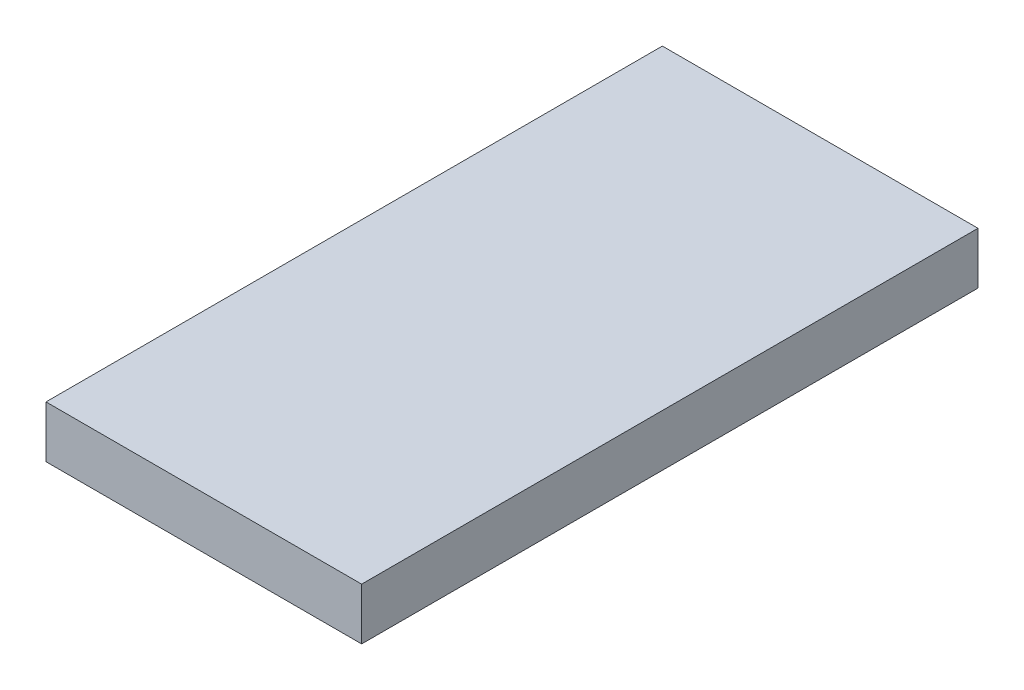
ISO-10303-21;
HEADER;
FILE_DESCRIPTION(('STEP AP214'),'2;1');
FILE_NAME('part.step','',(''),(''),'','','');
FILE_SCHEMA(('AUTOMOTIVE_DESIGN { 1 0 10303 214 1 1 1 1 }'));
ENDSEC;
DATA;
#1=APPLICATION_CONTEXT('core data for automotive mechanical design processes');
#2=APPLICATION_PROTOCOL_DEFINITION('international standard','automotive_design',2000,#1);
#3=PRODUCT_CONTEXT('',#1,'mechanical');
#4=PRODUCT('Part','Part','',(#3));
#5=PRODUCT_RELATED_PRODUCT_CATEGORY('part','',(#4));
#6=PRODUCT_DEFINITION_FORMATION('','',#4);
#7=PRODUCT_DEFINITION_CONTEXT('part definition',#1,'design');
#8=PRODUCT_DEFINITION('design','',#6,#7);
#9=PRODUCT_DEFINITION_SHAPE('','',#8);
#10=(LENGTH_UNIT() NAMED_UNIT(*) SI_UNIT(.MILLI.,.METRE.));
#11=(NAMED_UNIT(*) PLANE_ANGLE_UNIT() SI_UNIT($,.RADIAN.));
#12=(NAMED_UNIT(*) SI_UNIT($,.STERADIAN.) SOLID_ANGLE_UNIT());
#13=UNCERTAINTY_MEASURE_WITH_UNIT(LENGTH_MEASURE(1.E-05),#10,'distance_accuracy_value','');
#14=(GEOMETRIC_REPRESENTATION_CONTEXT(3) GLOBAL_UNCERTAINTY_ASSIGNED_CONTEXT((#13)) GLOBAL_UNIT_ASSIGNED_CONTEXT((#10,
#11,#12)) REPRESENTATION_CONTEXT('',''));
#15=CARTESIAN_POINT('',(0.,0.,0.));
#16=DIRECTION('',(0.,0.,1.));
#17=DIRECTION('',(1.,0.,0.));
#18=AXIS2_PLACEMENT_3D('',#15,#16,#17);
#19=CARTESIAN_POINT('',(0.,10.84,0.));
#20=DIRECTION('',(1.,0.,0.));
#21=DIRECTION('',(0.,0.,-1.));
#22=AXIS2_PLACEMENT_3D('',#19,#20,#21);
#23=PLANE('',#22);
#24=DIRECTION('',(0.,0.,1.));
#25=VECTOR('',#24,1.);
#26=CARTESIAN_POINT('',(0.,0.,0.));
#27=LINE('',#26,#25);
#28=CARTESIAN_POINT('',(0.,0.,-128.96));
#29=VERTEX_POINT('',#28);
#30=CARTESIAN_POINT('',(0.,0.,0.));
#31=VERTEX_POINT('',#30);
#32=EDGE_CURVE('E95',#29,#31,#27,.T.);
#33=ORIENTED_EDGE('',*,*,#32,.T.);
#34=DIRECTION('',(0.,-1.,0.));
#35=VECTOR('',#34,1.);
#36=CARTESIAN_POINT('',(0.,10.84,0.));
#37=LINE('',#36,#35);
#38=CARTESIAN_POINT('',(0.,10.84,0.));
#39=VERTEX_POINT('',#38);
#40=EDGE_CURVE('E11',#39,#31,#37,.T.);
#41=ORIENTED_EDGE('',*,*,#40,.F.);
#42=DIRECTION('',(0.,0.,1.));
#43=VECTOR('',#42,1.);
#44=CARTESIAN_POINT('',(0.,10.84,0.));
#45=LINE('',#44,#43);
#46=CARTESIAN_POINT('',(0.,10.84,-128.96));
#47=VERTEX_POINT('',#46);
#48=EDGE_CURVE('E83',#47,#39,#45,.T.);
#49=ORIENTED_EDGE('',*,*,#48,.F.);
#50=DIRECTION('',(0.,-1.,0.));
#51=VECTOR('',#50,1.);
#52=CARTESIAN_POINT('',(0.,10.84,-128.96));
#53=LINE('',#52,#51);
#54=EDGE_CURVE('E91',#47,#29,#53,.T.);
#55=ORIENTED_EDGE('',*,*,#54,.T.);
#56=EDGE_LOOP('',(#33,#41,#49,#55));
#57=FACE_BOUND('',#56,.T.);
#58=ADVANCED_FACE('F32',(#57),#23,.F.);
#59=CARTESIAN_POINT('',(0.,10.84,0.));
#60=DIRECTION('',(0.,0.,-1.));
#61=DIRECTION('',(-1.,0.,0.));
#62=AXIS2_PLACEMENT_3D('',#59,#60,#61);
#63=PLANE('',#62);
#64=DIRECTION('',(1.,0.,0.));
#65=VECTOR('',#64,1.);
#66=CARTESIAN_POINT('',(0.,0.,0.));
#67=LINE('',#66,#65);
#68=CARTESIAN_POINT('',(66.04,0.,0.));
#69=VERTEX_POINT('',#68);
#70=EDGE_CURVE('E87',#31,#69,#67,.T.);
#71=ORIENTED_EDGE('',*,*,#70,.T.);
#72=DIRECTION('',(0.,-1.,0.));
#73=VECTOR('',#72,1.);
#74=CARTESIAN_POINT('',(66.04,10.84,0.));
#75=LINE('',#74,#73);
#76=CARTESIAN_POINT('',(66.04,10.84,0.));
#77=VERTEX_POINT('',#76);
#78=EDGE_CURVE('E40',#77,#69,#75,.T.);
#79=ORIENTED_EDGE('',*,*,#78,.F.);
#80=DIRECTION('',(1.,0.,0.));
#81=VECTOR('',#80,1.);
#82=CARTESIAN_POINT('',(0.,10.84,0.));
#83=LINE('',#82,#81);
#84=EDGE_CURVE('E78',#39,#77,#83,.T.);
#85=ORIENTED_EDGE('',*,*,#84,.F.);
#86=ORIENTED_EDGE('',*,*,#40,.T.);
#87=EDGE_LOOP('',(#71,#79,#85,#86));
#88=FACE_BOUND('',#87,.T.);
#89=ADVANCED_FACE('F86',(#88),#63,.F.);
#90=CARTESIAN_POINT('',(66.04,10.84,0.));
#91=DIRECTION('',(-1.,0.,0.));
#92=DIRECTION('',(0.,0.,1.));
#93=AXIS2_PLACEMENT_3D('',#90,#91,#92);
#94=PLANE('',#93);
#95=DIRECTION('',(0.,0.,-1.));
#96=VECTOR('',#95,1.);
#97=CARTESIAN_POINT('',(66.04,0.,0.));
#98=LINE('',#97,#96);
#99=CARTESIAN_POINT('',(66.04,0.,-128.96));
#100=VERTEX_POINT('',#99);
#101=EDGE_CURVE('E65',#69,#100,#98,.T.);
#102=ORIENTED_EDGE('',*,*,#101,.T.);
#103=DIRECTION('',(0.,-1.,0.));
#104=VECTOR('',#103,1.);
#105=CARTESIAN_POINT('',(66.04,10.84,-128.96));
#106=LINE('',#105,#104);
#107=CARTESIAN_POINT('',(66.04,10.84,-128.96));
#108=VERTEX_POINT('',#107);
#109=EDGE_CURVE('E88',#108,#100,#106,.T.);
#110=ORIENTED_EDGE('',*,*,#109,.F.);
#111=DIRECTION('',(0.,0.,-1.));
#112=VECTOR('',#111,1.);
#113=CARTESIAN_POINT('',(66.04,10.84,0.));
#114=LINE('',#113,#112);
#115=EDGE_CURVE('E81',#77,#108,#114,.T.);
#116=ORIENTED_EDGE('',*,*,#115,.F.);
#117=ORIENTED_EDGE('',*,*,#78,.T.);
#118=EDGE_LOOP('',(#102,#110,#116,#117));
#119=FACE_BOUND('',#118,.T.);
#120=ADVANCED_FACE('F89',(#119),#94,.F.);
#121=CARTESIAN_POINT('',(0.,10.84,-128.96));
#122=DIRECTION('',(0.,0.,1.));
#123=DIRECTION('',(1.,0.,0.));
#124=AXIS2_PLACEMENT_3D('',#121,#122,#123);
#125=PLANE('',#124);
#126=DIRECTION('',(-1.,0.,0.));
#127=VECTOR('',#126,1.);
#128=CARTESIAN_POINT('',(0.,0.,-128.96));
#129=LINE('',#128,#127);
#130=EDGE_CURVE('E71',#100,#29,#129,.T.);
#131=ORIENTED_EDGE('',*,*,#130,.T.);
#132=ORIENTED_EDGE('',*,*,#54,.F.);
#133=DIRECTION('',(-1.,0.,0.));
#134=VECTOR('',#133,1.);
#135=CARTESIAN_POINT('',(0.,10.84,-128.96));
#136=LINE('',#135,#134);
#137=EDGE_CURVE('E48',#108,#47,#136,.T.);
#138=ORIENTED_EDGE('',*,*,#137,.F.);
#139=ORIENTED_EDGE('',*,*,#109,.T.);
#140=EDGE_LOOP('',(#131,#132,#138,#139));
#141=FACE_BOUND('',#140,.T.);
#142=ADVANCED_FACE('F102',(#141),#125,.F.);
#143=CARTESIAN_POINT('',(0.,10.84,0.));
#144=DIRECTION('',(0.,-1.,0.));
#145=DIRECTION('',(0.,0.,-1.));
#146=AXIS2_PLACEMENT_3D('',#143,#144,#145);
#147=PLANE('',#146);
#148=ORIENTED_EDGE('',*,*,#48,.T.);
#149=ORIENTED_EDGE('',*,*,#84,.T.);
#150=ORIENTED_EDGE('',*,*,#115,.T.);
#151=ORIENTED_EDGE('',*,*,#137,.T.);
#152=EDGE_LOOP('',(#148,#149,#150,#151));
#153=FACE_BOUND('',#152,.T.);
#154=ADVANCED_FACE('F79',(#153),#147,.F.);
#155=CARTESIAN_POINT('',(0.,0.,0.));
#156=DIRECTION('',(0.,-1.,0.));
#157=DIRECTION('',(0.,0.,-1.));
#158=AXIS2_PLACEMENT_3D('',#155,#156,#157);
#159=PLANE('',#158);
#160=ORIENTED_EDGE('',*,*,#32,.F.);
#161=ORIENTED_EDGE('',*,*,#130,.F.);
#162=ORIENTED_EDGE('',*,*,#101,.F.);
#163=ORIENTED_EDGE('',*,*,#70,.F.);
#164=EDGE_LOOP('',(#160,#161,#162,#163));
#165=FACE_BOUND('',#164,.T.);
#166=ADVANCED_FACE('F105',(#165),#159,.T.);
#167=CLOSED_SHELL('',(#58,#89,#120,#142,#154,#166));
#168=MANIFOLD_SOLID_BREP('B2',#167);
#169=ADVANCED_BREP_SHAPE_REPRESENTATION('',(#18,#168),#14);
#170=SHAPE_DEFINITION_REPRESENTATION(#9,#169);
ENDSEC;
END-ISO-10303-21;
